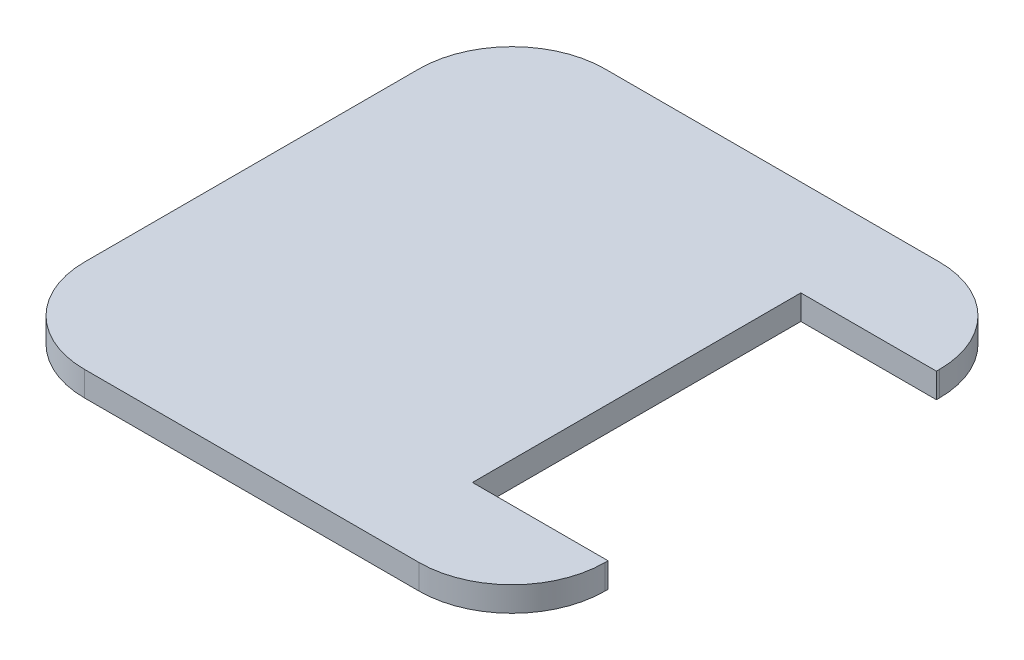
ISO-10303-21;
HEADER;
FILE_DESCRIPTION(('STEP AP214'),'2;1');
FILE_NAME('part.step','',(''),(''),'','','');
FILE_SCHEMA(('AUTOMOTIVE_DESIGN { 1 0 10303 214 1 1 1 1 }'));
ENDSEC;
DATA;
#1=APPLICATION_CONTEXT('core data for automotive mechanical design processes');
#2=APPLICATION_PROTOCOL_DEFINITION('international standard','automotive_design',2000,#1);
#3=PRODUCT_CONTEXT('',#1,'mechanical');
#4=PRODUCT('Part','Part','',(#3));
#5=PRODUCT_RELATED_PRODUCT_CATEGORY('part','',(#4));
#6=PRODUCT_DEFINITION_FORMATION('','',#4);
#7=PRODUCT_DEFINITION_CONTEXT('part definition',#1,'design');
#8=PRODUCT_DEFINITION('design','',#6,#7);
#9=PRODUCT_DEFINITION_SHAPE('','',#8);
#10=(LENGTH_UNIT() NAMED_UNIT(*) SI_UNIT(.MILLI.,.METRE.));
#11=(NAMED_UNIT(*) PLANE_ANGLE_UNIT() SI_UNIT($,.RADIAN.));
#12=(NAMED_UNIT(*) SI_UNIT($,.STERADIAN.) SOLID_ANGLE_UNIT());
#13=UNCERTAINTY_MEASURE_WITH_UNIT(LENGTH_MEASURE(1.E-05),#10,'distance_accuracy_value','');
#14=(GEOMETRIC_REPRESENTATION_CONTEXT(3) GLOBAL_UNCERTAINTY_ASSIGNED_CONTEXT((#13)) GLOBAL_UNIT_ASSIGNED_CONTEXT((#10,
#11,#12)) REPRESENTATION_CONTEXT('',''));
#15=CARTESIAN_POINT('',(0.,0.,0.));
#16=DIRECTION('',(0.,0.,1.));
#17=DIRECTION('',(1.,0.,0.));
#18=AXIS2_PLACEMENT_3D('',#15,#16,#17);
#19=CARTESIAN_POINT('',(42.,4.,0.));
#20=DIRECTION('',(-1.,0.,0.));
#21=DIRECTION('',(0.,0.,1.));
#22=AXIS2_PLACEMENT_3D('',#19,#20,#21);
#23=PLANE('',#22);
#24=DIRECTION('',(0.,1.,0.));
#25=VECTOR('',#24,1.);
#26=CARTESIAN_POINT('',(42.,0.,-26.5));
#27=LINE('',#26,#25);
#28=CARTESIAN_POINT('',(42.,0.,-26.5));
#29=VERTEX_POINT('',#28);
#30=CARTESIAN_POINT('',(42.,4.,-26.5));
#31=VERTEX_POINT('',#30);
#32=EDGE_CURVE('E150',#29,#31,#27,.T.);
#33=ORIENTED_EDGE('',*,*,#32,.F.);
#34=DIRECTION('',(0.,0.,-1.));
#35=VECTOR('',#34,1.);
#36=CARTESIAN_POINT('',(42.,0.,0.));
#37=LINE('',#36,#35);
#38=CARTESIAN_POINT('',(42.,0.,-27.));
#39=VERTEX_POINT('',#38);
#40=EDGE_CURVE('E133',#29,#39,#37,.T.);
#41=ORIENTED_EDGE('',*,*,#40,.T.);
#42=DIRECTION('',(0.,-1.,0.));
#43=VECTOR('',#42,1.);
#44=CARTESIAN_POINT('',(42.,4.,-27.));
#45=LINE('',#44,#43);
#46=CARTESIAN_POINT('',(42.,4.,-27.));
#47=VERTEX_POINT('',#46);
#48=EDGE_CURVE('E131',#47,#39,#45,.T.);
#49=ORIENTED_EDGE('',*,*,#48,.F.);
#50=DIRECTION('',(0.,0.,-1.));
#51=VECTOR('',#50,1.);
#52=CARTESIAN_POINT('',(42.,4.,0.));
#53=LINE('',#52,#51);
#54=EDGE_CURVE('E116',#31,#47,#53,.T.);
#55=ORIENTED_EDGE('',*,*,#54,.F.);
#56=EDGE_LOOP('',(#33,#41,#49,#55));
#57=FACE_BOUND('',#56,.T.);
#58=ADVANCED_FACE('F37',(#57),#23,.F.);
#59=CARTESIAN_POINT('',(0.,4.,0.));
#60=DIRECTION('',(0.,1.,0.));
#61=DIRECTION('',(0.,0.,1.));
#62=AXIS2_PLACEMENT_3D('',#59,#60,#61);
#63=PLANE('',#62);
#64=DIRECTION('',(0.,0.,-1.));
#65=VECTOR('',#64,1.);
#66=CARTESIAN_POINT('',(20.12,4.,0.));
#67=LINE('',#66,#65);
#68=CARTESIAN_POINT('',(20.12,4.,26.5));
#69=VERTEX_POINT('',#68);
#70=CARTESIAN_POINT('',(20.12,4.,-26.5));
#71=VERTEX_POINT('',#70);
#72=EDGE_CURVE('E224',#69,#71,#67,.T.);
#73=ORIENTED_EDGE('',*,*,#72,.T.);
#74=DIRECTION('',(1.,0.,0.));
#75=VECTOR('',#74,1.);
#76=CARTESIAN_POINT('',(0.,4.,-26.5));
#77=LINE('',#76,#75);
#78=EDGE_CURVE('E124',#71,#31,#77,.T.);
#79=ORIENTED_EDGE('',*,*,#78,.T.);
#80=ORIENTED_EDGE('',*,*,#54,.T.);
#81=CARTESIAN_POINT('',(27.,4.,-27.));
#82=DIRECTION('',(0.,1.,0.));
#83=DIRECTION('',(0.,0.,1.));
#84=AXIS2_PLACEMENT_3D('',#81,#82,#83);
#85=CIRCLE('',#84,15.);
#86=CARTESIAN_POINT('',(27.,4.,-42.));
#87=VERTEX_POINT('',#86);
#88=EDGE_CURVE('E122',#87,#47,#85,.F.);
#89=ORIENTED_EDGE('',*,*,#88,.F.);
#90=DIRECTION('',(1.,0.,0.));
#91=VECTOR('',#90,1.);
#92=CARTESIAN_POINT('',(0.,4.,-42.));
#93=LINE('',#92,#91);
#94=CARTESIAN_POINT('',(-27.,4.,-42.));
#95=VERTEX_POINT('',#94);
#96=EDGE_CURVE('E141',#95,#87,#93,.T.);
#97=ORIENTED_EDGE('',*,*,#96,.F.);
#98=CARTESIAN_POINT('',(-27.,4.,-27.));
#99=DIRECTION('',(0.,1.,0.));
#100=DIRECTION('',(0.,0.,1.));
#101=AXIS2_PLACEMENT_3D('',#98,#99,#100);
#102=CIRCLE('',#101,15.);
#103=CARTESIAN_POINT('',(-42.,4.,-27.));
#104=VERTEX_POINT('',#103);
#105=EDGE_CURVE('E168',#104,#95,#102,.F.);
#106=ORIENTED_EDGE('',*,*,#105,.F.);
#107=DIRECTION('',(0.,0.,-1.));
#108=VECTOR('',#107,1.);
#109=CARTESIAN_POINT('',(-42.,4.,0.));
#110=LINE('',#109,#108);
#111=CARTESIAN_POINT('',(-42.,4.,27.));
#112=VERTEX_POINT('',#111);
#113=EDGE_CURVE('E207',#112,#104,#110,.T.);
#114=ORIENTED_EDGE('',*,*,#113,.F.);
#115=CARTESIAN_POINT('',(-27.,4.,27.));
#116=DIRECTION('',(0.,1.,0.));
#117=DIRECTION('',(0.,0.,1.));
#118=AXIS2_PLACEMENT_3D('',#115,#116,#117);
#119=CIRCLE('',#118,15.);
#120=CARTESIAN_POINT('',(-27.,4.,42.));
#121=VERTEX_POINT('',#120);
#122=EDGE_CURVE('E183',#121,#112,#119,.F.);
#123=ORIENTED_EDGE('',*,*,#122,.F.);
#124=DIRECTION('',(1.,0.,0.));
#125=VECTOR('',#124,1.);
#126=CARTESIAN_POINT('',(0.,4.,42.));
#127=LINE('',#126,#125);
#128=CARTESIAN_POINT('',(27.,4.,42.));
#129=VERTEX_POINT('',#128);
#130=EDGE_CURVE('E203',#121,#129,#127,.T.);
#131=ORIENTED_EDGE('',*,*,#130,.T.);
#132=CARTESIAN_POINT('',(27.,4.,27.));
#133=DIRECTION('',(0.,1.,0.));
#134=DIRECTION('',(0.,0.,1.));
#135=AXIS2_PLACEMENT_3D('',#132,#133,#134);
#136=CIRCLE('',#135,15.);
#137=CARTESIAN_POINT('',(42.,4.,27.));
#138=VERTEX_POINT('',#137);
#139=EDGE_CURVE('E128',#129,#138,#136,.T.);
#140=ORIENTED_EDGE('',*,*,#139,.T.);
#141=CARTESIAN_POINT('',(42.,4.,26.5));
#142=VERTEX_POINT('',#141);
#143=EDGE_CURVE('E127',#138,#142,#53,.T.);
#144=ORIENTED_EDGE('',*,*,#143,.T.);
#145=DIRECTION('',(1.,0.,0.));
#146=VECTOR('',#145,1.);
#147=CARTESIAN_POINT('',(0.,4.,26.5));
#148=LINE('',#147,#146);
#149=EDGE_CURVE('E220',#69,#142,#148,.T.);
#150=ORIENTED_EDGE('',*,*,#149,.F.);
#151=EDGE_LOOP('',(#73,#79,#80,#89,#97,#106,#114,#123,#131,#140,#144,#150));
#152=FACE_BOUND('',#151,.T.);
#153=ADVANCED_FACE('F119',(#152),#63,.T.);
#154=CARTESIAN_POINT('',(0.,0.,0.));
#155=DIRECTION('',(0.,1.,0.));
#156=DIRECTION('',(0.,0.,1.));
#157=AXIS2_PLACEMENT_3D('',#154,#155,#156);
#158=PLANE('',#157);
#159=DIRECTION('',(1.,0.,0.));
#160=VECTOR('',#159,1.);
#161=CARTESIAN_POINT('',(0.,0.,-26.5));
#162=LINE('',#161,#160);
#163=CARTESIAN_POINT('',(20.12,0.,-26.5));
#164=VERTEX_POINT('',#163);
#165=EDGE_CURVE('E223',#164,#29,#162,.T.);
#166=ORIENTED_EDGE('',*,*,#165,.F.);
#167=DIRECTION('',(0.,0.,-1.));
#168=VECTOR('',#167,1.);
#169=CARTESIAN_POINT('',(20.12,0.,0.));
#170=LINE('',#169,#168);
#171=CARTESIAN_POINT('',(20.12,0.,26.5));
#172=VERTEX_POINT('',#171);
#173=EDGE_CURVE('E228',#172,#164,#170,.T.);
#174=ORIENTED_EDGE('',*,*,#173,.F.);
#175=DIRECTION('',(1.,0.,0.));
#176=VECTOR('',#175,1.);
#177=CARTESIAN_POINT('',(0.,0.,26.5));
#178=LINE('',#177,#176);
#179=CARTESIAN_POINT('',(42.,0.,26.5));
#180=VERTEX_POINT('',#179);
#181=EDGE_CURVE('E52',#172,#180,#178,.T.);
#182=ORIENTED_EDGE('',*,*,#181,.T.);
#183=CARTESIAN_POINT('',(42.,0.,27.));
#184=VERTEX_POINT('',#183);
#185=EDGE_CURVE('E160',#184,#180,#37,.T.);
#186=ORIENTED_EDGE('',*,*,#185,.F.);
#187=CARTESIAN_POINT('',(27.,0.,27.));
#188=DIRECTION('',(0.,1.,0.));
#189=DIRECTION('',(0.,0.,1.));
#190=AXIS2_PLACEMENT_3D('',#187,#188,#189);
#191=CIRCLE('',#190,15.);
#192=CARTESIAN_POINT('',(27.,0.,42.));
#193=VERTEX_POINT('',#192);
#194=EDGE_CURVE('E158',#193,#184,#191,.T.);
#195=ORIENTED_EDGE('',*,*,#194,.F.);
#196=DIRECTION('',(1.,0.,0.));
#197=VECTOR('',#196,1.);
#198=CARTESIAN_POINT('',(0.,0.,42.));
#199=LINE('',#198,#197);
#200=CARTESIAN_POINT('',(-27.,0.,42.));
#201=VERTEX_POINT('',#200);
#202=EDGE_CURVE('E156',#201,#193,#199,.T.);
#203=ORIENTED_EDGE('',*,*,#202,.F.);
#204=CARTESIAN_POINT('',(-27.,0.,27.));
#205=DIRECTION('',(0.,1.,0.));
#206=DIRECTION('',(0.,0.,1.));
#207=AXIS2_PLACEMENT_3D('',#204,#205,#206);
#208=CIRCLE('',#207,15.);
#209=CARTESIAN_POINT('',(-42.,0.,27.));
#210=VERTEX_POINT('',#209);
#211=EDGE_CURVE('E153',#201,#210,#208,.F.);
#212=ORIENTED_EDGE('',*,*,#211,.T.);
#213=DIRECTION('',(0.,0.,-1.));
#214=VECTOR('',#213,1.);
#215=CARTESIAN_POINT('',(-42.,0.,0.));
#216=LINE('',#215,#214);
#217=CARTESIAN_POINT('',(-42.,0.,-27.));
#218=VERTEX_POINT('',#217);
#219=EDGE_CURVE('E149',#210,#218,#216,.T.);
#220=ORIENTED_EDGE('',*,*,#219,.T.);
#221=CARTESIAN_POINT('',(-27.,0.,-27.));
#222=DIRECTION('',(0.,1.,0.));
#223=DIRECTION('',(0.,0.,1.));
#224=AXIS2_PLACEMENT_3D('',#221,#222,#223);
#225=CIRCLE('',#224,15.);
#226=CARTESIAN_POINT('',(-27.,0.,-42.));
#227=VERTEX_POINT('',#226);
#228=EDGE_CURVE('E147',#218,#227,#225,.F.);
#229=ORIENTED_EDGE('',*,*,#228,.T.);
#230=DIRECTION('',(1.,0.,0.));
#231=VECTOR('',#230,1.);
#232=CARTESIAN_POINT('',(0.,0.,-42.));
#233=LINE('',#232,#231);
#234=CARTESIAN_POINT('',(27.,0.,-42.));
#235=VERTEX_POINT('',#234);
#236=EDGE_CURVE('E165',#227,#235,#233,.T.);
#237=ORIENTED_EDGE('',*,*,#236,.T.);
#238=CARTESIAN_POINT('',(27.,0.,-27.));
#239=DIRECTION('',(0.,1.,0.));
#240=DIRECTION('',(0.,0.,1.));
#241=AXIS2_PLACEMENT_3D('',#238,#239,#240);
#242=CIRCLE('',#241,15.);
#243=EDGE_CURVE('E163',#235,#39,#242,.F.);
#244=ORIENTED_EDGE('',*,*,#243,.T.);
#245=ORIENTED_EDGE('',*,*,#40,.F.);
#246=EDGE_LOOP('',(#166,#174,#182,#186,#195,#203,#212,#220,#229,#237,#244,#245));
#247=FACE_BOUND('',#246,.T.);
#248=ADVANCED_FACE('F191',(#247),#158,.F.);
#249=CARTESIAN_POINT('',(-27.,4.,-27.));
#250=DIRECTION('',(0.,-1.,0.));
#251=DIRECTION('',(0.,0.,-1.));
#252=AXIS2_PLACEMENT_3D('',#249,#250,#251);
#253=CYLINDRICAL_SURFACE('',#252,15.);
#254=ORIENTED_EDGE('',*,*,#228,.F.);
#255=DIRECTION('',(0.,-1.,0.));
#256=VECTOR('',#255,1.);
#257=CARTESIAN_POINT('',(-42.,4.,-27.));
#258=LINE('',#257,#256);
#259=EDGE_CURVE('E11',#104,#218,#258,.T.);
#260=ORIENTED_EDGE('',*,*,#259,.F.);
#261=ORIENTED_EDGE('',*,*,#105,.T.);
#262=DIRECTION('',(0.,-1.,0.));
#263=VECTOR('',#262,1.);
#264=CARTESIAN_POINT('',(-27.,4.,-42.));
#265=LINE('',#264,#263);
#266=EDGE_CURVE('E61',#95,#227,#265,.T.);
#267=ORIENTED_EDGE('',*,*,#266,.T.);
#268=EDGE_LOOP('',(#254,#260,#261,#267));
#269=FACE_BOUND('',#268,.T.);
#270=ADVANCED_FACE('F39',(#269),#253,.T.);
#271=CARTESIAN_POINT('',(-42.,4.,0.));
#272=DIRECTION('',(-1.,0.,0.));
#273=DIRECTION('',(0.,0.,1.));
#274=AXIS2_PLACEMENT_3D('',#271,#272,#273);
#275=PLANE('',#274);
#276=ORIENTED_EDGE('',*,*,#219,.F.);
#277=DIRECTION('',(0.,-1.,0.));
#278=VECTOR('',#277,1.);
#279=CARTESIAN_POINT('',(-42.,4.,27.));
#280=LINE('',#279,#278);
#281=EDGE_CURVE('E45',#112,#210,#280,.T.);
#282=ORIENTED_EDGE('',*,*,#281,.F.);
#283=ORIENTED_EDGE('',*,*,#113,.T.);
#284=ORIENTED_EDGE('',*,*,#259,.T.);
#285=EDGE_LOOP('',(#276,#282,#283,#284));
#286=FACE_BOUND('',#285,.T.);
#287=ADVANCED_FACE('F187',(#286),#275,.T.);
#288=CARTESIAN_POINT('',(-27.,4.,27.));
#289=DIRECTION('',(0.,-1.,0.));
#290=DIRECTION('',(0.,0.,-1.));
#291=AXIS2_PLACEMENT_3D('',#288,#289,#290);
#292=CYLINDRICAL_SURFACE('',#291,15.);
#293=ORIENTED_EDGE('',*,*,#211,.F.);
#294=DIRECTION('',(0.,-1.,0.));
#295=VECTOR('',#294,1.);
#296=CARTESIAN_POINT('',(-27.,4.,42.));
#297=LINE('',#296,#295);
#298=EDGE_CURVE('E176',#121,#201,#297,.T.);
#299=ORIENTED_EDGE('',*,*,#298,.F.);
#300=ORIENTED_EDGE('',*,*,#122,.T.);
#301=ORIENTED_EDGE('',*,*,#281,.T.);
#302=EDGE_LOOP('',(#293,#299,#300,#301));
#303=FACE_BOUND('',#302,.T.);
#304=ADVANCED_FACE('F181',(#303),#292,.T.);
#305=CARTESIAN_POINT('',(0.,4.,42.));
#306=DIRECTION('',(0.,0.,-1.));
#307=DIRECTION('',(-1.,0.,0.));
#308=AXIS2_PLACEMENT_3D('',#305,#306,#307);
#309=PLANE('',#308);
#310=ORIENTED_EDGE('',*,*,#202,.T.);
#311=DIRECTION('',(0.,-1.,0.));
#312=VECTOR('',#311,1.);
#313=CARTESIAN_POINT('',(27.,4.,42.));
#314=LINE('',#313,#312);
#315=EDGE_CURVE('E173',#129,#193,#314,.T.);
#316=ORIENTED_EDGE('',*,*,#315,.F.);
#317=ORIENTED_EDGE('',*,*,#130,.F.);
#318=ORIENTED_EDGE('',*,*,#298,.T.);
#319=EDGE_LOOP('',(#310,#316,#317,#318));
#320=FACE_BOUND('',#319,.T.);
#321=ADVANCED_FACE('F196',(#320),#309,.F.);
#322=CARTESIAN_POINT('',(27.,4.,27.));
#323=DIRECTION('',(0.,-1.,0.));
#324=DIRECTION('',(0.,0.,-1.));
#325=AXIS2_PLACEMENT_3D('',#322,#323,#324);
#326=CYLINDRICAL_SURFACE('',#325,15.);
#327=ORIENTED_EDGE('',*,*,#194,.T.);
#328=DIRECTION('',(0.,-1.,0.));
#329=VECTOR('',#328,1.);
#330=CARTESIAN_POINT('',(42.,4.,27.));
#331=LINE('',#330,#329);
#332=EDGE_CURVE('E137',#138,#184,#331,.T.);
#333=ORIENTED_EDGE('',*,*,#332,.F.);
#334=ORIENTED_EDGE('',*,*,#139,.F.);
#335=ORIENTED_EDGE('',*,*,#315,.T.);
#336=EDGE_LOOP('',(#327,#333,#334,#335));
#337=FACE_BOUND('',#336,.T.);
#338=ADVANCED_FACE('F200',(#337),#326,.T.);
#339=ORIENTED_EDGE('',*,*,#185,.T.);
#340=DIRECTION('',(0.,1.,0.));
#341=VECTOR('',#340,1.);
#342=CARTESIAN_POINT('',(42.,0.,26.5));
#343=LINE('',#342,#341);
#344=EDGE_CURVE('E215',#180,#142,#343,.T.);
#345=ORIENTED_EDGE('',*,*,#344,.T.);
#346=ORIENTED_EDGE('',*,*,#143,.F.);
#347=ORIENTED_EDGE('',*,*,#332,.T.);
#348=EDGE_LOOP('',(#339,#345,#346,#347));
#349=FACE_BOUND('',#348,.T.);
#350=ADVANCED_FACE('F248',(#349),#23,.F.);
#351=CARTESIAN_POINT('',(27.,4.,-27.));
#352=DIRECTION('',(0.,-1.,0.));
#353=DIRECTION('',(0.,0.,-1.));
#354=AXIS2_PLACEMENT_3D('',#351,#352,#353);
#355=CYLINDRICAL_SURFACE('',#354,15.);
#356=ORIENTED_EDGE('',*,*,#243,.F.);
#357=DIRECTION('',(0.,-1.,0.));
#358=VECTOR('',#357,1.);
#359=CARTESIAN_POINT('',(27.,4.,-42.));
#360=LINE('',#359,#358);
#361=EDGE_CURVE('E138',#87,#235,#360,.T.);
#362=ORIENTED_EDGE('',*,*,#361,.F.);
#363=ORIENTED_EDGE('',*,*,#88,.T.);
#364=ORIENTED_EDGE('',*,*,#48,.T.);
#365=EDGE_LOOP('',(#356,#362,#363,#364));
#366=FACE_BOUND('',#365,.T.);
#367=ADVANCED_FACE('F140',(#366),#355,.T.);
#368=CARTESIAN_POINT('',(0.,4.,-42.));
#369=DIRECTION('',(0.,0.,-1.));
#370=DIRECTION('',(-1.,0.,0.));
#371=AXIS2_PLACEMENT_3D('',#368,#369,#370);
#372=PLANE('',#371);
#373=ORIENTED_EDGE('',*,*,#236,.F.);
#374=ORIENTED_EDGE('',*,*,#266,.F.);
#375=ORIENTED_EDGE('',*,*,#96,.T.);
#376=ORIENTED_EDGE('',*,*,#361,.T.);
#377=EDGE_LOOP('',(#373,#374,#375,#376));
#378=FACE_BOUND('',#377,.T.);
#379=ADVANCED_FACE('F239',(#378),#372,.T.);
#380=CARTESIAN_POINT('',(0.,0.,-26.5));
#381=DIRECTION('',(0.,0.,1.));
#382=DIRECTION('',(1.,0.,0.));
#383=AXIS2_PLACEMENT_3D('',#380,#381,#382);
#384=PLANE('',#383);
#385=ORIENTED_EDGE('',*,*,#78,.F.);
#386=DIRECTION('',(0.,1.,0.));
#387=VECTOR('',#386,1.);
#388=CARTESIAN_POINT('',(20.12,0.,-26.5));
#389=LINE('',#388,#387);
#390=EDGE_CURVE('E210',#164,#71,#389,.T.);
#391=ORIENTED_EDGE('',*,*,#390,.F.);
#392=ORIENTED_EDGE('',*,*,#165,.T.);
#393=ORIENTED_EDGE('',*,*,#32,.T.);
#394=EDGE_LOOP('',(#385,#391,#392,#393));
#395=FACE_BOUND('',#394,.T.);
#396=ADVANCED_FACE('F234',(#395),#384,.T.);
#397=CARTESIAN_POINT('',(0.,0.,26.5));
#398=DIRECTION('',(0.,0.,1.));
#399=DIRECTION('',(1.,0.,0.));
#400=AXIS2_PLACEMENT_3D('',#397,#398,#399);
#401=PLANE('',#400);
#402=ORIENTED_EDGE('',*,*,#149,.T.);
#403=ORIENTED_EDGE('',*,*,#344,.F.);
#404=ORIENTED_EDGE('',*,*,#181,.F.);
#405=DIRECTION('',(0.,1.,0.));
#406=VECTOR('',#405,1.);
#407=CARTESIAN_POINT('',(20.12,0.,26.5));
#408=LINE('',#407,#406);
#409=EDGE_CURVE('E213',#172,#69,#408,.T.);
#410=ORIENTED_EDGE('',*,*,#409,.T.);
#411=EDGE_LOOP('',(#402,#403,#404,#410));
#412=FACE_BOUND('',#411,.T.);
#413=ADVANCED_FACE('F272',(#412),#401,.F.);
#414=CARTESIAN_POINT('',(20.12,0.,0.));
#415=DIRECTION('',(1.,0.,0.));
#416=DIRECTION('',(0.,0.,-1.));
#417=AXIS2_PLACEMENT_3D('',#414,#415,#416);
#418=PLANE('',#417);
#419=ORIENTED_EDGE('',*,*,#72,.F.);
#420=ORIENTED_EDGE('',*,*,#409,.F.);
#421=ORIENTED_EDGE('',*,*,#173,.T.);
#422=ORIENTED_EDGE('',*,*,#390,.T.);
#423=EDGE_LOOP('',(#419,#420,#421,#422));
#424=FACE_BOUND('',#423,.T.);
#425=ADVANCED_FACE('F265',(#424),#418,.T.);
#426=CLOSED_SHELL('',(#58,#153,#248,#270,#287,#304,#321,#338,#350,#367,#379,#396,#413,#425));
#427=MANIFOLD_SOLID_BREP('B2',#426);
#428=ADVANCED_BREP_SHAPE_REPRESENTATION('',(#18,#427),#14);
#429=SHAPE_DEFINITION_REPRESENTATION(#9,#428);
ENDSEC;
END-ISO-10303-21;
